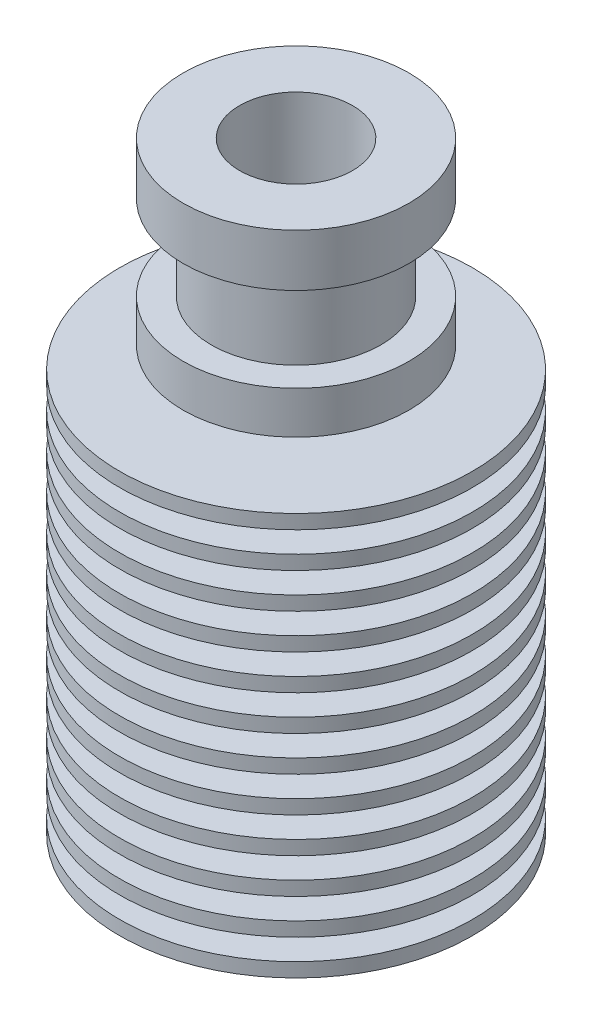
ISO-10303-21;
HEADER;
FILE_DESCRIPTION(('STEP AP214'),'2;1');
FILE_NAME('part.step','',(''),(''),'','','');
FILE_SCHEMA(('AUTOMOTIVE_DESIGN { 1 0 10303 214 1 1 1 1 }'));
ENDSEC;
DATA;
#1=APPLICATION_CONTEXT('core data for automotive mechanical design processes');
#2=APPLICATION_PROTOCOL_DEFINITION('international standard','automotive_design',2000,#1);
#3=PRODUCT_CONTEXT('',#1,'mechanical');
#4=PRODUCT('Part','Part','',(#3));
#5=PRODUCT_RELATED_PRODUCT_CATEGORY('part','',(#4));
#6=PRODUCT_DEFINITION_FORMATION('','',#4);
#7=PRODUCT_DEFINITION_CONTEXT('part definition',#1,'design');
#8=PRODUCT_DEFINITION('design','',#6,#7);
#9=PRODUCT_DEFINITION_SHAPE('','',#8);
#10=(LENGTH_UNIT() NAMED_UNIT(*) SI_UNIT(.MILLI.,.METRE.));
#11=(NAMED_UNIT(*) PLANE_ANGLE_UNIT() SI_UNIT($,.RADIAN.));
#12=(NAMED_UNIT(*) SI_UNIT($,.STERADIAN.) SOLID_ANGLE_UNIT());
#13=UNCERTAINTY_MEASURE_WITH_UNIT(LENGTH_MEASURE(1.E-05),#10,'distance_accuracy_value','');
#14=(GEOMETRIC_REPRESENTATION_CONTEXT(3) GLOBAL_UNCERTAINTY_ASSIGNED_CONTEXT((#13)) GLOBAL_UNIT_ASSIGNED_CONTEXT((#10,
#11,#12)) REPRESENTATION_CONTEXT('',''));
#15=CARTESIAN_POINT('',(0.,0.,0.));
#16=DIRECTION('',(0.,0.,1.));
#17=DIRECTION('',(1.,0.,0.));
#18=AXIS2_PLACEMENT_3D('',#15,#16,#17);
#19=CARTESIAN_POINT('',(0.,-21.35,0.));
#20=DIRECTION('',(0.,-1.,0.));
#21=DIRECTION('',(0.,0.,-1.));
#22=AXIS2_PLACEMENT_3D('',#19,#20,#21);
#23=CYLINDRICAL_SURFACE('',#22,3.5);
#24=CARTESIAN_POINT('',(0.,-21.35,0.));
#25=DIRECTION('',(0.,-1.,0.));
#26=DIRECTION('',(0.,0.,-1.));
#27=AXIS2_PLACEMENT_3D('',#24,#25,#26);
#28=CIRCLE('',#27,3.5);
#29=CARTESIAN_POINT('',(0.,-21.35,-3.5));
#30=VERTEX_POINT('',#29);
#31=EDGE_CURVE('E215',#30,#30,#28,.T.);
#32=ORIENTED_EDGE('',*,*,#31,.T.);
#33=EDGE_LOOP('',(#32));
#34=FACE_BOUND('',#33,.T.);
#35=CARTESIAN_POINT('',(0.,-6.55,0.));
#36=DIRECTION('',(0.,-1.,0.));
#37=DIRECTION('',(0.,0.,-1.));
#38=AXIS2_PLACEMENT_3D('',#35,#36,#37);
#39=CIRCLE('',#38,3.5);
#40=CARTESIAN_POINT('',(0.,-6.55,-3.5));
#41=VERTEX_POINT('',#40);
#42=EDGE_CURVE('E10',#41,#41,#39,.T.);
#43=ORIENTED_EDGE('',*,*,#42,.F.);
#44=EDGE_LOOP('',(#43));
#45=FACE_BOUND('',#44,.T.);
#46=ADVANCED_FACE('F31',(#34,#45),#23,.F.);
#47=CARTESIAN_POINT('',(0.,-5.74170962313453,0.));
#48=DIRECTION('',(0.,-1.,0.));
#49=DIRECTION('',(0.,0.,-1.));
#50=AXIS2_PLACEMENT_3D('',#47,#48,#49);
#51=CONICAL_SURFACE('',#50,2.1,1.0471975511966);
#52=ORIENTED_EDGE('',*,*,#42,.T.);
#53=EDGE_LOOP('',(#52));
#54=FACE_BOUND('',#53,.T.);
#55=CARTESIAN_POINT('',(0.,-5.74170962313453,0.));
#56=DIRECTION('',(0.,-1.,0.));
#57=DIRECTION('',(0.,0.,-1.));
#58=AXIS2_PLACEMENT_3D('',#55,#56,#57);
#59=CIRCLE('',#58,2.1);
#60=CARTESIAN_POINT('',(0.,-5.74170962313453,-2.1));
#61=VERTEX_POINT('',#60);
#62=EDGE_CURVE('E37',#61,#61,#59,.T.);
#63=ORIENTED_EDGE('',*,*,#62,.F.);
#64=EDGE_LOOP('',(#63));
#65=FACE_BOUND('',#64,.T.);
#66=ADVANCED_FACE('F233',(#54,#65),#51,.F.);
#67=CARTESIAN_POINT('',(0.,-21.35,0.));
#68=DIRECTION('',(0.,-1.,0.));
#69=DIRECTION('',(0.,0.,-1.));
#70=AXIS2_PLACEMENT_3D('',#67,#68,#69);
#71=CYLINDRICAL_SURFACE('',#70,2.1);
#72=ORIENTED_EDGE('',*,*,#62,.T.);
#73=EDGE_LOOP('',(#72));
#74=FACE_BOUND('',#73,.T.);
#75=CARTESIAN_POINT('',(0.,10.2530344885397,0.));
#76=DIRECTION('',(0.,-1.,0.));
#77=DIRECTION('',(0.,0.,-1.));
#78=AXIS2_PLACEMENT_3D('',#75,#76,#77);
#79=CIRCLE('',#78,2.1);
#80=CARTESIAN_POINT('',(0.,10.2530344885397,-2.1));
#81=VERTEX_POINT('',#80);
#82=EDGE_CURVE('E41',#81,#81,#79,.T.);
#83=ORIENTED_EDGE('',*,*,#82,.F.);
#84=EDGE_LOOP('',(#83));
#85=FACE_BOUND('',#84,.T.);
#86=ADVANCED_FACE('F237',(#74,#85),#71,.F.);
#87=CARTESIAN_POINT('',(0.,11.35,0.));
#88=DIRECTION('',(0.,1.,0.));
#89=DIRECTION('',(0.,0.,1.));
#90=AXIS2_PLACEMENT_3D('',#87,#88,#89);
#91=CONICAL_SURFACE('',#90,4.,1.0471975511966);
#92=ORIENTED_EDGE('',*,*,#82,.T.);
#93=EDGE_LOOP('',(#92));
#94=FACE_BOUND('',#93,.T.);
#95=CARTESIAN_POINT('',(0.,11.35,0.));
#96=DIRECTION('',(0.,-1.,0.));
#97=DIRECTION('',(0.,0.,-1.));
#98=AXIS2_PLACEMENT_3D('',#95,#96,#97);
#99=CIRCLE('',#98,4.);
#100=CARTESIAN_POINT('',(0.,11.35,-4.));
#101=VERTEX_POINT('',#100);
#102=EDGE_CURVE('E45',#101,#101,#99,.T.);
#103=ORIENTED_EDGE('',*,*,#102,.F.);
#104=EDGE_LOOP('',(#103));
#105=FACE_BOUND('',#104,.T.);
#106=ADVANCED_FACE('F241',(#94,#105),#91,.F.);
#107=CARTESIAN_POINT('',(0.,-21.35,0.));
#108=DIRECTION('',(0.,-1.,0.));
#109=DIRECTION('',(0.,0.,-1.));
#110=AXIS2_PLACEMENT_3D('',#107,#108,#109);
#111=CYLINDRICAL_SURFACE('',#110,4.);
#112=ORIENTED_EDGE('',*,*,#102,.T.);
#113=EDGE_LOOP('',(#112));
#114=FACE_BOUND('',#113,.T.);
#115=CARTESIAN_POINT('',(0.,21.35,0.));
#116=DIRECTION('',(0.,-1.,0.));
#117=DIRECTION('',(0.,0.,-1.));
#118=AXIS2_PLACEMENT_3D('',#115,#116,#117);
#119=CIRCLE('',#118,4.);
#120=CARTESIAN_POINT('',(0.,21.35,-4.));
#121=VERTEX_POINT('',#120);
#122=EDGE_CURVE('E50',#121,#121,#119,.T.);
#123=ORIENTED_EDGE('',*,*,#122,.F.);
#124=EDGE_LOOP('',(#123));
#125=FACE_BOUND('',#124,.T.);
#126=ADVANCED_FACE('F247',(#114,#125),#111,.F.);
#127=CARTESIAN_POINT('',(4.,21.35,0.));
#128=DIRECTION('',(0.,1.,0.));
#129=DIRECTION('',(0.,0.,1.));
#130=AXIS2_PLACEMENT_3D('',#127,#128,#129);
#131=PLANE('',#130);
#132=ORIENTED_EDGE('',*,*,#122,.T.);
#133=EDGE_LOOP('',(#132));
#134=FACE_BOUND('',#133,.T.);
#135=CARTESIAN_POINT('',(0.,21.35,0.));
#136=DIRECTION('',(0.,-1.,0.));
#137=DIRECTION('',(0.,0.,-1.));
#138=AXIS2_PLACEMENT_3D('',#135,#136,#137);
#139=CIRCLE('',#138,8.);
#140=CARTESIAN_POINT('',(0.,21.35,-8.));
#141=VERTEX_POINT('',#140);
#142=EDGE_CURVE('E53',#141,#141,#139,.T.);
#143=ORIENTED_EDGE('',*,*,#142,.F.);
#144=EDGE_LOOP('',(#143));
#145=FACE_BOUND('',#144,.T.);
#146=ADVANCED_FACE('F251',(#134,#145),#131,.T.);
#147=CARTESIAN_POINT('',(0.,-21.35,0.));
#148=DIRECTION('',(0.,-1.,0.));
#149=DIRECTION('',(0.,0.,-1.));
#150=AXIS2_PLACEMENT_3D('',#147,#148,#149);
#151=CYLINDRICAL_SURFACE('',#150,8.);
#152=ORIENTED_EDGE('',*,*,#142,.T.);
#153=EDGE_LOOP('',(#152));
#154=FACE_BOUND('',#153,.T.);
#155=CARTESIAN_POINT('',(0.,17.65,0.));
#156=DIRECTION('',(0.,-1.,0.));
#157=DIRECTION('',(0.,0.,-1.));
#158=AXIS2_PLACEMENT_3D('',#155,#156,#157);
#159=CIRCLE('',#158,8.);
#160=CARTESIAN_POINT('',(0.,17.65,-8.));
#161=VERTEX_POINT('',#160);
#162=EDGE_CURVE('E56',#161,#161,#159,.T.);
#163=ORIENTED_EDGE('',*,*,#162,.F.);
#164=EDGE_LOOP('',(#163));
#165=FACE_BOUND('',#164,.T.);
#166=ADVANCED_FACE('F255',(#154,#165),#151,.T.);
#167=CARTESIAN_POINT('',(6.,17.65,0.));
#168=DIRECTION('',(0.,-1.,0.));
#169=DIRECTION('',(0.,0.,-1.));
#170=AXIS2_PLACEMENT_3D('',#167,#168,#169);
#171=PLANE('',#170);
#172=ORIENTED_EDGE('',*,*,#162,.T.);
#173=EDGE_LOOP('',(#172));
#174=FACE_BOUND('',#173,.T.);
#175=CARTESIAN_POINT('',(0.,17.65,0.));
#176=DIRECTION('',(0.,-1.,0.));
#177=DIRECTION('',(0.,0.,-1.));
#178=AXIS2_PLACEMENT_3D('',#175,#176,#177);
#179=CIRCLE('',#178,6.);
#180=CARTESIAN_POINT('',(0.,17.65,-6.));
#181=VERTEX_POINT('',#180);
#182=EDGE_CURVE('E59',#181,#181,#179,.T.);
#183=ORIENTED_EDGE('',*,*,#182,.F.);
#184=EDGE_LOOP('',(#183));
#185=FACE_BOUND('',#184,.T.);
#186=ADVANCED_FACE('F259',(#174,#185),#171,.T.);
#187=CARTESIAN_POINT('',(0.,-21.35,0.));
#188=DIRECTION('',(0.,-1.,0.));
#189=DIRECTION('',(0.,0.,-1.));
#190=AXIS2_PLACEMENT_3D('',#187,#188,#189);
#191=CYLINDRICAL_SURFACE('',#190,6.);
#192=ORIENTED_EDGE('',*,*,#182,.T.);
#193=EDGE_LOOP('',(#192));
#194=FACE_BOUND('',#193,.T.);
#195=CARTESIAN_POINT('',(0.,11.65,0.));
#196=DIRECTION('',(0.,-1.,0.));
#197=DIRECTION('',(0.,0.,-1.));
#198=AXIS2_PLACEMENT_3D('',#195,#196,#197);
#199=CIRCLE('',#198,6.);
#200=CARTESIAN_POINT('',(0.,11.65,-6.));
#201=VERTEX_POINT('',#200);
#202=EDGE_CURVE('E62',#201,#201,#199,.T.);
#203=ORIENTED_EDGE('',*,*,#202,.F.);
#204=EDGE_LOOP('',(#203));
#205=FACE_BOUND('',#204,.T.);
#206=ADVANCED_FACE('F263',(#194,#205),#191,.T.);
#207=CARTESIAN_POINT('',(8.,11.65,0.));
#208=DIRECTION('',(0.,1.,0.));
#209=DIRECTION('',(0.,0.,1.));
#210=AXIS2_PLACEMENT_3D('',#207,#208,#209);
#211=PLANE('',#210);
#212=ORIENTED_EDGE('',*,*,#202,.T.);
#213=EDGE_LOOP('',(#212));
#214=FACE_BOUND('',#213,.T.);
#215=CARTESIAN_POINT('',(0.,11.65,0.));
#216=DIRECTION('',(0.,-1.,0.));
#217=DIRECTION('',(0.,0.,-1.));
#218=AXIS2_PLACEMENT_3D('',#215,#216,#217);
#219=CIRCLE('',#218,8.);
#220=CARTESIAN_POINT('',(0.,11.65,-8.));
#221=VERTEX_POINT('',#220);
#222=EDGE_CURVE('E65',#221,#221,#219,.T.);
#223=ORIENTED_EDGE('',*,*,#222,.F.);
#224=EDGE_LOOP('',(#223));
#225=FACE_BOUND('',#224,.T.);
#226=ADVANCED_FACE('F267',(#214,#225),#211,.T.);
#227=CARTESIAN_POINT('',(0.,-21.35,0.));
#228=DIRECTION('',(0.,-1.,0.));
#229=DIRECTION('',(0.,0.,-1.));
#230=AXIS2_PLACEMENT_3D('',#227,#228,#229);
#231=CYLINDRICAL_SURFACE('',#230,8.);
#232=ORIENTED_EDGE('',*,*,#222,.T.);
#233=EDGE_LOOP('',(#232));
#234=FACE_BOUND('',#233,.T.);
#235=CARTESIAN_POINT('',(0.,8.65,0.));
#236=DIRECTION('',(0.,-1.,0.));
#237=DIRECTION('',(0.,0.,-1.));
#238=AXIS2_PLACEMENT_3D('',#235,#236,#237);
#239=CIRCLE('',#238,8.);
#240=CARTESIAN_POINT('',(0.,8.65,-8.));
#241=VERTEX_POINT('',#240);
#242=EDGE_CURVE('E68',#241,#241,#239,.T.);
#243=ORIENTED_EDGE('',*,*,#242,.F.);
#244=EDGE_LOOP('',(#243));
#245=FACE_BOUND('',#244,.T.);
#246=ADVANCED_FACE('F271',(#234,#245),#231,.T.);
#247=CARTESIAN_POINT('',(4.3975,8.65,0.));
#248=DIRECTION('',(0.,-1.,0.));
#249=DIRECTION('',(0.,0.,-1.));
#250=AXIS2_PLACEMENT_3D('',#247,#248,#249);
#251=PLANE('',#250);
#252=ORIENTED_EDGE('',*,*,#242,.T.);
#253=EDGE_LOOP('',(#252));
#254=FACE_BOUND('',#253,.T.);
#255=CARTESIAN_POINT('',(0.,8.65,0.));
#256=DIRECTION('',(0.,-1.,0.));
#257=DIRECTION('',(0.,0.,-1.));
#258=AXIS2_PLACEMENT_3D('',#255,#256,#257);
#259=CIRCLE('',#258,4.3975);
#260=CARTESIAN_POINT('',(0.,8.65,-4.3975));
#261=VERTEX_POINT('',#260);
#262=EDGE_CURVE('E71',#261,#261,#259,.T.);
#263=ORIENTED_EDGE('',*,*,#262,.F.);
#264=EDGE_LOOP('',(#263));
#265=FACE_BOUND('',#264,.T.);
#266=ADVANCED_FACE('F275',(#254,#265),#251,.T.);
#267=CARTESIAN_POINT('',(0.,-21.35,0.));
#268=DIRECTION('',(0.,-1.,0.));
#269=DIRECTION('',(0.,0.,-1.));
#270=AXIS2_PLACEMENT_3D('',#267,#268,#269);
#271=CYLINDRICAL_SURFACE('',#270,4.3975);
#272=ORIENTED_EDGE('',*,*,#262,.T.);
#273=EDGE_LOOP('',(#272));
#274=FACE_BOUND('',#273,.T.);
#275=CARTESIAN_POINT('',(0.,7.15,0.));
#276=DIRECTION('',(0.,-1.,0.));
#277=DIRECTION('',(0.,0.,-1.));
#278=AXIS2_PLACEMENT_3D('',#275,#276,#277);
#279=CIRCLE('',#278,4.3975);
#280=CARTESIAN_POINT('',(0.,7.15,-4.3975));
#281=VERTEX_POINT('',#280);
#282=EDGE_CURVE('E74',#281,#281,#279,.T.);
#283=ORIENTED_EDGE('',*,*,#282,.F.);
#284=EDGE_LOOP('',(#283));
#285=FACE_BOUND('',#284,.T.);
#286=ADVANCED_FACE('F279',(#274,#285),#271,.T.);
#287=CARTESIAN_POINT('',(4.3975,7.15,0.));
#288=DIRECTION('',(0.,1.,0.));
#289=DIRECTION('',(0.,0.,1.));
#290=AXIS2_PLACEMENT_3D('',#287,#288,#289);
#291=PLANE('',#290);
#292=ORIENTED_EDGE('',*,*,#282,.T.);
#293=EDGE_LOOP('',(#292));
#294=FACE_BOUND('',#293,.T.);
#295=CARTESIAN_POINT('',(0.,7.15,0.));
#296=DIRECTION('',(0.,-1.,0.));
#297=DIRECTION('',(0.,0.,-1.));
#298=AXIS2_PLACEMENT_3D('',#295,#296,#297);
#299=CIRCLE('',#298,12.5);
#300=CARTESIAN_POINT('',(0.,7.15,-12.5));
#301=VERTEX_POINT('',#300);
#302=EDGE_CURVE('E77',#301,#301,#299,.T.);
#303=ORIENTED_EDGE('',*,*,#302,.F.);
#304=EDGE_LOOP('',(#303));
#305=FACE_BOUND('',#304,.T.);
#306=ADVANCED_FACE('F283',(#294,#305),#291,.T.);
#307=CARTESIAN_POINT('',(0.,-21.35,0.));
#308=DIRECTION('',(0.,-1.,0.));
#309=DIRECTION('',(0.,0.,-1.));
#310=AXIS2_PLACEMENT_3D('',#307,#308,#309);
#311=CYLINDRICAL_SURFACE('',#310,12.5);
#312=ORIENTED_EDGE('',*,*,#302,.T.);
#313=EDGE_LOOP('',(#312));
#314=FACE_BOUND('',#313,.T.);
#315=CARTESIAN_POINT('',(0.,6.15,0.));
#316=DIRECTION('',(0.,-1.,0.));
#317=DIRECTION('',(0.,0.,-1.));
#318=AXIS2_PLACEMENT_3D('',#315,#316,#317);
#319=CIRCLE('',#318,12.5);
#320=CARTESIAN_POINT('',(0.,6.15,-12.5));
#321=VERTEX_POINT('',#320);
#322=EDGE_CURVE('E80',#321,#321,#319,.T.);
#323=ORIENTED_EDGE('',*,*,#322,.F.);
#324=EDGE_LOOP('',(#323));
#325=FACE_BOUND('',#324,.T.);
#326=ADVANCED_FACE('F287',(#314,#325),#311,.T.);
#327=CARTESIAN_POINT('',(12.5,6.15,0.));
#328=DIRECTION('',(0.,-1.,0.));
#329=DIRECTION('',(0.,0.,-1.));
#330=AXIS2_PLACEMENT_3D('',#327,#328,#329);
#331=PLANE('',#330);
#332=ORIENTED_EDGE('',*,*,#322,.T.);
#333=EDGE_LOOP('',(#332));
#334=FACE_BOUND('',#333,.T.);
#335=CARTESIAN_POINT('',(0.,6.15,0.));
#336=DIRECTION('',(0.,-1.,0.));
#337=DIRECTION('',(0.,0.,-1.));
#338=AXIS2_PLACEMENT_3D('',#335,#336,#337);
#339=CIRCLE('',#338,4.3975);
#340=CARTESIAN_POINT('',(0.,6.15,-4.3975));
#341=VERTEX_POINT('',#340);
#342=EDGE_CURVE('E83',#341,#341,#339,.T.);
#343=ORIENTED_EDGE('',*,*,#342,.F.);
#344=EDGE_LOOP('',(#343));
#345=FACE_BOUND('',#344,.T.);
#346=ADVANCED_FACE('F291',(#334,#345),#331,.T.);
#347=CARTESIAN_POINT('',(0.,-21.35,0.));
#348=DIRECTION('',(0.,-1.,0.));
#349=DIRECTION('',(0.,0.,-1.));
#350=AXIS2_PLACEMENT_3D('',#347,#348,#349);
#351=CYLINDRICAL_SURFACE('',#350,4.3975);
#352=ORIENTED_EDGE('',*,*,#342,.T.);
#353=EDGE_LOOP('',(#352));
#354=FACE_BOUND('',#353,.T.);
#355=CARTESIAN_POINT('',(0.,4.65,0.));
#356=DIRECTION('',(0.,-1.,0.));
#357=DIRECTION('',(0.,0.,-1.));
#358=AXIS2_PLACEMENT_3D('',#355,#356,#357);
#359=CIRCLE('',#358,4.3975);
#360=CARTESIAN_POINT('',(0.,4.65,-4.3975));
#361=VERTEX_POINT('',#360);
#362=EDGE_CURVE('E86',#361,#361,#359,.T.);
#363=ORIENTED_EDGE('',*,*,#362,.F.);
#364=EDGE_LOOP('',(#363));
#365=FACE_BOUND('',#364,.T.);
#366=ADVANCED_FACE('F295',(#354,#365),#351,.T.);
#367=CARTESIAN_POINT('',(4.3975,4.65,0.));
#368=DIRECTION('',(0.,1.,0.));
#369=DIRECTION('',(0.,0.,1.));
#370=AXIS2_PLACEMENT_3D('',#367,#368,#369);
#371=PLANE('',#370);
#372=ORIENTED_EDGE('',*,*,#362,.T.);
#373=EDGE_LOOP('',(#372));
#374=FACE_BOUND('',#373,.T.);
#375=CARTESIAN_POINT('',(0.,4.65,0.));
#376=DIRECTION('',(0.,-1.,0.));
#377=DIRECTION('',(0.,0.,-1.));
#378=AXIS2_PLACEMENT_3D('',#375,#376,#377);
#379=CIRCLE('',#378,12.5);
#380=CARTESIAN_POINT('',(0.,4.65,-12.5));
#381=VERTEX_POINT('',#380);
#382=EDGE_CURVE('E89',#381,#381,#379,.T.);
#383=ORIENTED_EDGE('',*,*,#382,.F.);
#384=EDGE_LOOP('',(#383));
#385=FACE_BOUND('',#384,.T.);
#386=ADVANCED_FACE('F299',(#374,#385),#371,.T.);
#387=CARTESIAN_POINT('',(0.,-21.35,0.));
#388=DIRECTION('',(0.,-1.,0.));
#389=DIRECTION('',(0.,0.,-1.));
#390=AXIS2_PLACEMENT_3D('',#387,#388,#389);
#391=CYLINDRICAL_SURFACE('',#390,12.5);
#392=ORIENTED_EDGE('',*,*,#382,.T.);
#393=EDGE_LOOP('',(#392));
#394=FACE_BOUND('',#393,.T.);
#395=CARTESIAN_POINT('',(0.,3.65,0.));
#396=DIRECTION('',(0.,-1.,0.));
#397=DIRECTION('',(0.,0.,-1.));
#398=AXIS2_PLACEMENT_3D('',#395,#396,#397);
#399=CIRCLE('',#398,12.5);
#400=CARTESIAN_POINT('',(0.,3.65,-12.5));
#401=VERTEX_POINT('',#400);
#402=EDGE_CURVE('E92',#401,#401,#399,.T.);
#403=ORIENTED_EDGE('',*,*,#402,.F.);
#404=EDGE_LOOP('',(#403));
#405=FACE_BOUND('',#404,.T.);
#406=ADVANCED_FACE('F303',(#394,#405),#391,.T.);
#407=CARTESIAN_POINT('',(12.5,3.65,0.));
#408=DIRECTION('',(0.,-1.,0.));
#409=DIRECTION('',(0.,0.,-1.));
#410=AXIS2_PLACEMENT_3D('',#407,#408,#409);
#411=PLANE('',#410);
#412=ORIENTED_EDGE('',*,*,#402,.T.);
#413=EDGE_LOOP('',(#412));
#414=FACE_BOUND('',#413,.T.);
#415=CARTESIAN_POINT('',(0.,3.65,0.));
#416=DIRECTION('',(0.,-1.,0.));
#417=DIRECTION('',(0.,0.,-1.));
#418=AXIS2_PLACEMENT_3D('',#415,#416,#417);
#419=CIRCLE('',#418,4.58175);
#420=CARTESIAN_POINT('',(0.,3.65,-4.58175));
#421=VERTEX_POINT('',#420);
#422=EDGE_CURVE('E95',#421,#421,#419,.T.);
#423=ORIENTED_EDGE('',*,*,#422,.F.);
#424=EDGE_LOOP('',(#423));
#425=FACE_BOUND('',#424,.T.);
#426=ADVANCED_FACE('F307',(#414,#425),#411,.T.);
#427=CARTESIAN_POINT('',(0.,-21.35,0.));
#428=DIRECTION('',(0.,-1.,0.));
#429=DIRECTION('',(0.,0.,-1.));
#430=AXIS2_PLACEMENT_3D('',#427,#428,#429);
#431=CYLINDRICAL_SURFACE('',#430,4.58175);
#432=ORIENTED_EDGE('',*,*,#422,.T.);
#433=EDGE_LOOP('',(#432));
#434=FACE_BOUND('',#433,.T.);
#435=CARTESIAN_POINT('',(0.,2.15,0.));
#436=DIRECTION('',(0.,-1.,0.));
#437=DIRECTION('',(0.,0.,-1.));
#438=AXIS2_PLACEMENT_3D('',#435,#436,#437);
#439=CIRCLE('',#438,4.58175);
#440=CARTESIAN_POINT('',(0.,2.15,-4.58175));
#441=VERTEX_POINT('',#440);
#442=EDGE_CURVE('E98',#441,#441,#439,.T.);
#443=ORIENTED_EDGE('',*,*,#442,.F.);
#444=EDGE_LOOP('',(#443));
#445=FACE_BOUND('',#444,.T.);
#446=ADVANCED_FACE('F311',(#434,#445),#431,.T.);
#447=CARTESIAN_POINT('',(4.58175,2.14999999999999,0.));
#448=DIRECTION('',(0.,1.,0.));
#449=DIRECTION('',(0.,0.,1.));
#450=AXIS2_PLACEMENT_3D('',#447,#448,#449);
#451=PLANE('',#450);
#452=ORIENTED_EDGE('',*,*,#442,.T.);
#453=EDGE_LOOP('',(#452));
#454=FACE_BOUND('',#453,.T.);
#455=CARTESIAN_POINT('',(0.,2.15,0.));
#456=DIRECTION('',(0.,-1.,0.));
#457=DIRECTION('',(0.,0.,-1.));
#458=AXIS2_PLACEMENT_3D('',#455,#456,#457);
#459=CIRCLE('',#458,12.5);
#460=CARTESIAN_POINT('',(0.,2.15,-12.5));
#461=VERTEX_POINT('',#460);
#462=EDGE_CURVE('E101',#461,#461,#459,.T.);
#463=ORIENTED_EDGE('',*,*,#462,.F.);
#464=EDGE_LOOP('',(#463));
#465=FACE_BOUND('',#464,.T.);
#466=ADVANCED_FACE('F315',(#454,#465),#451,.T.);
#467=CARTESIAN_POINT('',(0.,-21.35,0.));
#468=DIRECTION('',(0.,-1.,0.));
#469=DIRECTION('',(0.,0.,-1.));
#470=AXIS2_PLACEMENT_3D('',#467,#468,#469);
#471=CYLINDRICAL_SURFACE('',#470,12.5);
#472=ORIENTED_EDGE('',*,*,#462,.T.);
#473=EDGE_LOOP('',(#472));
#474=FACE_BOUND('',#473,.T.);
#475=CARTESIAN_POINT('',(0.,1.14999999999999,0.));
#476=DIRECTION('',(0.,-1.,0.));
#477=DIRECTION('',(0.,0.,-1.));
#478=AXIS2_PLACEMENT_3D('',#475,#476,#477);
#479=CIRCLE('',#478,12.5);
#480=CARTESIAN_POINT('',(0.,1.14999999999999,-12.5));
#481=VERTEX_POINT('',#480);
#482=EDGE_CURVE('E104',#481,#481,#479,.T.);
#483=ORIENTED_EDGE('',*,*,#482,.F.);
#484=EDGE_LOOP('',(#483));
#485=FACE_BOUND('',#484,.T.);
#486=ADVANCED_FACE('F319',(#474,#485),#471,.T.);
#487=CARTESIAN_POINT('',(12.5,1.14999999999999,0.));
#488=DIRECTION('',(0.,-1.,0.));
#489=DIRECTION('',(0.,0.,-1.));
#490=AXIS2_PLACEMENT_3D('',#487,#488,#489);
#491=PLANE('',#490);
#492=ORIENTED_EDGE('',*,*,#482,.T.);
#493=EDGE_LOOP('',(#492));
#494=FACE_BOUND('',#493,.T.);
#495=CARTESIAN_POINT('',(0.,1.14999999999999,0.));
#496=DIRECTION('',(0.,-1.,0.));
#497=DIRECTION('',(0.,0.,-1.));
#498=AXIS2_PLACEMENT_3D('',#495,#496,#497);
#499=CIRCLE('',#498,4.766);
#500=CARTESIAN_POINT('',(0.,1.14999999999999,-4.766));
#501=VERTEX_POINT('',#500);
#502=EDGE_CURVE('E107',#501,#501,#499,.T.);
#503=ORIENTED_EDGE('',*,*,#502,.F.);
#504=EDGE_LOOP('',(#503));
#505=FACE_BOUND('',#504,.T.);
#506=ADVANCED_FACE('F323',(#494,#505),#491,.T.);
#507=CARTESIAN_POINT('',(0.,-21.35,0.));
#508=DIRECTION('',(0.,-1.,0.));
#509=DIRECTION('',(0.,0.,-1.));
#510=AXIS2_PLACEMENT_3D('',#507,#508,#509);
#511=CYLINDRICAL_SURFACE('',#510,4.766);
#512=ORIENTED_EDGE('',*,*,#502,.T.);
#513=EDGE_LOOP('',(#512));
#514=FACE_BOUND('',#513,.T.);
#515=CARTESIAN_POINT('',(0.,-0.35000000000001,0.));
#516=DIRECTION('',(0.,-1.,0.));
#517=DIRECTION('',(0.,0.,-1.));
#518=AXIS2_PLACEMENT_3D('',#515,#516,#517);
#519=CIRCLE('',#518,4.766);
#520=CARTESIAN_POINT('',(0.,-0.35000000000001,-4.766));
#521=VERTEX_POINT('',#520);
#522=EDGE_CURVE('E110',#521,#521,#519,.T.);
#523=ORIENTED_EDGE('',*,*,#522,.F.);
#524=EDGE_LOOP('',(#523));
#525=FACE_BOUND('',#524,.T.);
#526=ADVANCED_FACE('F327',(#514,#525),#511,.T.);
#527=CARTESIAN_POINT('',(4.766,-0.350000000000009,0.));
#528=DIRECTION('',(0.,1.,0.));
#529=DIRECTION('',(0.,0.,1.));
#530=AXIS2_PLACEMENT_3D('',#527,#528,#529);
#531=PLANE('',#530);
#532=ORIENTED_EDGE('',*,*,#522,.T.);
#533=EDGE_LOOP('',(#532));
#534=FACE_BOUND('',#533,.T.);
#535=CARTESIAN_POINT('',(0.,-0.350000000000007,0.));
#536=DIRECTION('',(0.,-1.,0.));
#537=DIRECTION('',(0.,0.,-1.));
#538=AXIS2_PLACEMENT_3D('',#535,#536,#537);
#539=CIRCLE('',#538,12.5);
#540=CARTESIAN_POINT('',(0.,-0.350000000000007,-12.5));
#541=VERTEX_POINT('',#540);
#542=EDGE_CURVE('E113',#541,#541,#539,.T.);
#543=ORIENTED_EDGE('',*,*,#542,.F.);
#544=EDGE_LOOP('',(#543));
#545=FACE_BOUND('',#544,.T.);
#546=ADVANCED_FACE('F331',(#534,#545),#531,.T.);
#547=CARTESIAN_POINT('',(0.,-21.35,0.));
#548=DIRECTION('',(0.,-1.,0.));
#549=DIRECTION('',(0.,0.,-1.));
#550=AXIS2_PLACEMENT_3D('',#547,#548,#549);
#551=CYLINDRICAL_SURFACE('',#550,12.5);
#552=ORIENTED_EDGE('',*,*,#542,.T.);
#553=EDGE_LOOP('',(#552));
#554=FACE_BOUND('',#553,.T.);
#555=CARTESIAN_POINT('',(0.,-1.35000000000001,0.));
#556=DIRECTION('',(0.,-1.,0.));
#557=DIRECTION('',(0.,0.,-1.));
#558=AXIS2_PLACEMENT_3D('',#555,#556,#557);
#559=CIRCLE('',#558,12.5);
#560=CARTESIAN_POINT('',(0.,-1.35000000000001,-12.5));
#561=VERTEX_POINT('',#560);
#562=EDGE_CURVE('E116',#561,#561,#559,.T.);
#563=ORIENTED_EDGE('',*,*,#562,.F.);
#564=EDGE_LOOP('',(#563));
#565=FACE_BOUND('',#564,.T.);
#566=ADVANCED_FACE('F335',(#554,#565),#551,.T.);
#567=CARTESIAN_POINT('',(12.5,-1.35000000000001,0.));
#568=DIRECTION('',(0.,-1.,0.));
#569=DIRECTION('',(0.,0.,-1.));
#570=AXIS2_PLACEMENT_3D('',#567,#568,#569);
#571=PLANE('',#570);
#572=ORIENTED_EDGE('',*,*,#562,.T.);
#573=EDGE_LOOP('',(#572));
#574=FACE_BOUND('',#573,.T.);
#575=CARTESIAN_POINT('',(0.,-1.35000000000001,0.));
#576=DIRECTION('',(0.,-1.,0.));
#577=DIRECTION('',(0.,0.,-1.));
#578=AXIS2_PLACEMENT_3D('',#575,#576,#577);
#579=CIRCLE('',#578,4.95025);
#580=CARTESIAN_POINT('',(0.,-1.35000000000001,-4.95025));
#581=VERTEX_POINT('',#580);
#582=EDGE_CURVE('E119',#581,#581,#579,.T.);
#583=ORIENTED_EDGE('',*,*,#582,.F.);
#584=EDGE_LOOP('',(#583));
#585=FACE_BOUND('',#584,.T.);
#586=ADVANCED_FACE('F339',(#574,#585),#571,.T.);
#587=CARTESIAN_POINT('',(0.,-21.35,0.));
#588=DIRECTION('',(0.,-1.,0.));
#589=DIRECTION('',(0.,0.,-1.));
#590=AXIS2_PLACEMENT_3D('',#587,#588,#589);
#591=CYLINDRICAL_SURFACE('',#590,4.95025);
#592=ORIENTED_EDGE('',*,*,#582,.T.);
#593=EDGE_LOOP('',(#592));
#594=FACE_BOUND('',#593,.T.);
#595=CARTESIAN_POINT('',(0.,-2.85000000000001,0.));
#596=DIRECTION('',(0.,-1.,0.));
#597=DIRECTION('',(0.,0.,-1.));
#598=AXIS2_PLACEMENT_3D('',#595,#596,#597);
#599=CIRCLE('',#598,4.95025);
#600=CARTESIAN_POINT('',(0.,-2.85000000000001,-4.95025));
#601=VERTEX_POINT('',#600);
#602=EDGE_CURVE('E122',#601,#601,#599,.T.);
#603=ORIENTED_EDGE('',*,*,#602,.F.);
#604=EDGE_LOOP('',(#603));
#605=FACE_BOUND('',#604,.T.);
#606=ADVANCED_FACE('F343',(#594,#605),#591,.T.);
#607=CARTESIAN_POINT('',(4.95025,-2.85000000000001,0.));
#608=DIRECTION('',(0.,1.,0.));
#609=DIRECTION('',(0.,0.,1.));
#610=AXIS2_PLACEMENT_3D('',#607,#608,#609);
#611=PLANE('',#610);
#612=ORIENTED_EDGE('',*,*,#602,.T.);
#613=EDGE_LOOP('',(#612));
#614=FACE_BOUND('',#613,.T.);
#615=CARTESIAN_POINT('',(0.,-2.85000000000001,0.));
#616=DIRECTION('',(0.,-1.,0.));
#617=DIRECTION('',(0.,0.,-1.));
#618=AXIS2_PLACEMENT_3D('',#615,#616,#617);
#619=CIRCLE('',#618,12.5);
#620=CARTESIAN_POINT('',(0.,-2.85000000000001,-12.5));
#621=VERTEX_POINT('',#620);
#622=EDGE_CURVE('E125',#621,#621,#619,.T.);
#623=ORIENTED_EDGE('',*,*,#622,.F.);
#624=EDGE_LOOP('',(#623));
#625=FACE_BOUND('',#624,.T.);
#626=ADVANCED_FACE('F347',(#614,#625),#611,.T.);
#627=CARTESIAN_POINT('',(0.,-21.35,0.));
#628=DIRECTION('',(0.,-1.,0.));
#629=DIRECTION('',(0.,0.,-1.));
#630=AXIS2_PLACEMENT_3D('',#627,#628,#629);
#631=CYLINDRICAL_SURFACE('',#630,12.5);
#632=ORIENTED_EDGE('',*,*,#622,.T.);
#633=EDGE_LOOP('',(#632));
#634=FACE_BOUND('',#633,.T.);
#635=CARTESIAN_POINT('',(0.,-3.85000000000001,0.));
#636=DIRECTION('',(0.,-1.,0.));
#637=DIRECTION('',(0.,0.,-1.));
#638=AXIS2_PLACEMENT_3D('',#635,#636,#637);
#639=CIRCLE('',#638,12.5);
#640=CARTESIAN_POINT('',(0.,-3.85000000000001,-12.5));
#641=VERTEX_POINT('',#640);
#642=EDGE_CURVE('E128',#641,#641,#639,.T.);
#643=ORIENTED_EDGE('',*,*,#642,.F.);
#644=EDGE_LOOP('',(#643));
#645=FACE_BOUND('',#644,.T.);
#646=ADVANCED_FACE('F351',(#634,#645),#631,.T.);
#647=CARTESIAN_POINT('',(12.5,-3.85000000000001,0.));
#648=DIRECTION('',(0.,-1.,0.));
#649=DIRECTION('',(0.,0.,-1.));
#650=AXIS2_PLACEMENT_3D('',#647,#648,#649);
#651=PLANE('',#650);
#652=ORIENTED_EDGE('',*,*,#642,.T.);
#653=EDGE_LOOP('',(#652));
#654=FACE_BOUND('',#653,.T.);
#655=CARTESIAN_POINT('',(0.,-3.85000000000001,0.));
#656=DIRECTION('',(0.,-1.,0.));
#657=DIRECTION('',(0.,0.,-1.));
#658=AXIS2_PLACEMENT_3D('',#655,#656,#657);
#659=CIRCLE('',#658,5.1345);
#660=CARTESIAN_POINT('',(0.,-3.85000000000001,-5.1345));
#661=VERTEX_POINT('',#660);
#662=EDGE_CURVE('E131',#661,#661,#659,.T.);
#663=ORIENTED_EDGE('',*,*,#662,.F.);
#664=EDGE_LOOP('',(#663));
#665=FACE_BOUND('',#664,.T.);
#666=ADVANCED_FACE('F355',(#654,#665),#651,.T.);
#667=CARTESIAN_POINT('',(0.,-21.35,0.));
#668=DIRECTION('',(0.,-1.,0.));
#669=DIRECTION('',(0.,0.,-1.));
#670=AXIS2_PLACEMENT_3D('',#667,#668,#669);
#671=CYLINDRICAL_SURFACE('',#670,5.1345);
#672=ORIENTED_EDGE('',*,*,#662,.T.);
#673=EDGE_LOOP('',(#672));
#674=FACE_BOUND('',#673,.T.);
#675=CARTESIAN_POINT('',(0.,-5.35000000000001,0.));
#676=DIRECTION('',(0.,-1.,0.));
#677=DIRECTION('',(0.,0.,-1.));
#678=AXIS2_PLACEMENT_3D('',#675,#676,#677);
#679=CIRCLE('',#678,5.1345);
#680=CARTESIAN_POINT('',(0.,-5.35000000000001,-5.1345));
#681=VERTEX_POINT('',#680);
#682=EDGE_CURVE('E134',#681,#681,#679,.T.);
#683=ORIENTED_EDGE('',*,*,#682,.F.);
#684=EDGE_LOOP('',(#683));
#685=FACE_BOUND('',#684,.T.);
#686=ADVANCED_FACE('F359',(#674,#685),#671,.T.);
#687=CARTESIAN_POINT('',(5.1345,-5.35000000000001,0.));
#688=DIRECTION('',(0.,1.,0.));
#689=DIRECTION('',(0.,0.,1.));
#690=AXIS2_PLACEMENT_3D('',#687,#688,#689);
#691=PLANE('',#690);
#692=ORIENTED_EDGE('',*,*,#682,.T.);
#693=EDGE_LOOP('',(#692));
#694=FACE_BOUND('',#693,.T.);
#695=CARTESIAN_POINT('',(0.,-5.35000000000001,0.));
#696=DIRECTION('',(0.,-1.,0.));
#697=DIRECTION('',(0.,0.,-1.));
#698=AXIS2_PLACEMENT_3D('',#695,#696,#697);
#699=CIRCLE('',#698,12.5);
#700=CARTESIAN_POINT('',(0.,-5.35000000000001,-12.5));
#701=VERTEX_POINT('',#700);
#702=EDGE_CURVE('E137',#701,#701,#699,.T.);
#703=ORIENTED_EDGE('',*,*,#702,.F.);
#704=EDGE_LOOP('',(#703));
#705=FACE_BOUND('',#704,.T.);
#706=ADVANCED_FACE('F363',(#694,#705),#691,.T.);
#707=CARTESIAN_POINT('',(0.,-21.35,0.));
#708=DIRECTION('',(0.,-1.,0.));
#709=DIRECTION('',(0.,0.,-1.));
#710=AXIS2_PLACEMENT_3D('',#707,#708,#709);
#711=CYLINDRICAL_SURFACE('',#710,12.5);
#712=ORIENTED_EDGE('',*,*,#702,.T.);
#713=EDGE_LOOP('',(#712));
#714=FACE_BOUND('',#713,.T.);
#715=CARTESIAN_POINT('',(0.,-6.35000000000002,0.));
#716=DIRECTION('',(0.,-1.,0.));
#717=DIRECTION('',(0.,0.,-1.));
#718=AXIS2_PLACEMENT_3D('',#715,#716,#717);
#719=CIRCLE('',#718,12.5);
#720=CARTESIAN_POINT('',(0.,-6.35000000000002,-12.5));
#721=VERTEX_POINT('',#720);
#722=EDGE_CURVE('E140',#721,#721,#719,.T.);
#723=ORIENTED_EDGE('',*,*,#722,.F.);
#724=EDGE_LOOP('',(#723));
#725=FACE_BOUND('',#724,.T.);
#726=ADVANCED_FACE('F367',(#714,#725),#711,.T.);
#727=CARTESIAN_POINT('',(12.5,-6.35000000000002,0.));
#728=DIRECTION('',(0.,-1.,0.));
#729=DIRECTION('',(0.,0.,-1.));
#730=AXIS2_PLACEMENT_3D('',#727,#728,#729);
#731=PLANE('',#730);
#732=ORIENTED_EDGE('',*,*,#722,.T.);
#733=EDGE_LOOP('',(#732));
#734=FACE_BOUND('',#733,.T.);
#735=CARTESIAN_POINT('',(0.,-6.35000000000002,0.));
#736=DIRECTION('',(0.,-1.,0.));
#737=DIRECTION('',(0.,0.,-1.));
#738=AXIS2_PLACEMENT_3D('',#735,#736,#737);
#739=CIRCLE('',#738,5.31875);
#740=CARTESIAN_POINT('',(0.,-6.35000000000002,-5.31875));
#741=VERTEX_POINT('',#740);
#742=EDGE_CURVE('E143',#741,#741,#739,.T.);
#743=ORIENTED_EDGE('',*,*,#742,.F.);
#744=EDGE_LOOP('',(#743));
#745=FACE_BOUND('',#744,.T.);
#746=ADVANCED_FACE('F371',(#734,#745),#731,.T.);
#747=CARTESIAN_POINT('',(0.,-21.35,0.));
#748=DIRECTION('',(0.,-1.,0.));
#749=DIRECTION('',(0.,0.,-1.));
#750=AXIS2_PLACEMENT_3D('',#747,#748,#749);
#751=CYLINDRICAL_SURFACE('',#750,5.31875);
#752=ORIENTED_EDGE('',*,*,#742,.T.);
#753=EDGE_LOOP('',(#752));
#754=FACE_BOUND('',#753,.T.);
#755=CARTESIAN_POINT('',(0.,-7.85000000000002,0.));
#756=DIRECTION('',(0.,-1.,0.));
#757=DIRECTION('',(0.,0.,-1.));
#758=AXIS2_PLACEMENT_3D('',#755,#756,#757);
#759=CIRCLE('',#758,5.31875);
#760=CARTESIAN_POINT('',(0.,-7.85000000000002,-5.31875));
#761=VERTEX_POINT('',#760);
#762=EDGE_CURVE('E146',#761,#761,#759,.T.);
#763=ORIENTED_EDGE('',*,*,#762,.F.);
#764=EDGE_LOOP('',(#763));
#765=FACE_BOUND('',#764,.T.);
#766=ADVANCED_FACE('F375',(#754,#765),#751,.T.);
#767=CARTESIAN_POINT('',(5.31875,-7.85000000000002,0.));
#768=DIRECTION('',(0.,1.,0.));
#769=DIRECTION('',(0.,0.,1.));
#770=AXIS2_PLACEMENT_3D('',#767,#768,#769);
#771=PLANE('',#770);
#772=ORIENTED_EDGE('',*,*,#762,.T.);
#773=EDGE_LOOP('',(#772));
#774=FACE_BOUND('',#773,.T.);
#775=CARTESIAN_POINT('',(0.,-7.85000000000002,0.));
#776=DIRECTION('',(0.,-1.,0.));
#777=DIRECTION('',(0.,0.,-1.));
#778=AXIS2_PLACEMENT_3D('',#775,#776,#777);
#779=CIRCLE('',#778,12.5);
#780=CARTESIAN_POINT('',(0.,-7.85000000000002,-12.5));
#781=VERTEX_POINT('',#780);
#782=EDGE_CURVE('E149',#781,#781,#779,.T.);
#783=ORIENTED_EDGE('',*,*,#782,.F.);
#784=EDGE_LOOP('',(#783));
#785=FACE_BOUND('',#784,.T.);
#786=ADVANCED_FACE('F379',(#774,#785),#771,.T.);
#787=CARTESIAN_POINT('',(0.,-21.35,0.));
#788=DIRECTION('',(0.,-1.,0.));
#789=DIRECTION('',(0.,0.,-1.));
#790=AXIS2_PLACEMENT_3D('',#787,#788,#789);
#791=CYLINDRICAL_SURFACE('',#790,12.5);
#792=ORIENTED_EDGE('',*,*,#782,.T.);
#793=EDGE_LOOP('',(#792));
#794=FACE_BOUND('',#793,.T.);
#795=CARTESIAN_POINT('',(0.,-8.85000000000002,0.));
#796=DIRECTION('',(0.,-1.,0.));
#797=DIRECTION('',(0.,0.,-1.));
#798=AXIS2_PLACEMENT_3D('',#795,#796,#797);
#799=CIRCLE('',#798,12.5);
#800=CARTESIAN_POINT('',(0.,-8.85000000000002,-12.5));
#801=VERTEX_POINT('',#800);
#802=EDGE_CURVE('E152',#801,#801,#799,.T.);
#803=ORIENTED_EDGE('',*,*,#802,.F.);
#804=EDGE_LOOP('',(#803));
#805=FACE_BOUND('',#804,.T.);
#806=ADVANCED_FACE('F383',(#794,#805),#791,.T.);
#807=CARTESIAN_POINT('',(12.5,-8.85000000000002,0.));
#808=DIRECTION('',(0.,-1.,0.));
#809=DIRECTION('',(0.,0.,-1.));
#810=AXIS2_PLACEMENT_3D('',#807,#808,#809);
#811=PLANE('',#810);
#812=ORIENTED_EDGE('',*,*,#802,.T.);
#813=EDGE_LOOP('',(#812));
#814=FACE_BOUND('',#813,.T.);
#815=CARTESIAN_POINT('',(0.,-8.85000000000002,0.));
#816=DIRECTION('',(0.,-1.,0.));
#817=DIRECTION('',(0.,0.,-1.));
#818=AXIS2_PLACEMENT_3D('',#815,#816,#817);
#819=CIRCLE('',#818,5.503);
#820=CARTESIAN_POINT('',(0.,-8.85000000000002,-5.503));
#821=VERTEX_POINT('',#820);
#822=EDGE_CURVE('E155',#821,#821,#819,.T.);
#823=ORIENTED_EDGE('',*,*,#822,.F.);
#824=EDGE_LOOP('',(#823));
#825=FACE_BOUND('',#824,.T.);
#826=ADVANCED_FACE('F387',(#814,#825),#811,.T.);
#827=CARTESIAN_POINT('',(0.,-21.35,0.));
#828=DIRECTION('',(0.,-1.,0.));
#829=DIRECTION('',(0.,0.,-1.));
#830=AXIS2_PLACEMENT_3D('',#827,#828,#829);
#831=CYLINDRICAL_SURFACE('',#830,5.503);
#832=ORIENTED_EDGE('',*,*,#822,.T.);
#833=EDGE_LOOP('',(#832));
#834=FACE_BOUND('',#833,.T.);
#835=CARTESIAN_POINT('',(0.,-10.35,0.));
#836=DIRECTION('',(0.,-1.,0.));
#837=DIRECTION('',(0.,0.,-1.));
#838=AXIS2_PLACEMENT_3D('',#835,#836,#837);
#839=CIRCLE('',#838,5.503);
#840=CARTESIAN_POINT('',(0.,-10.35,-5.503));
#841=VERTEX_POINT('',#840);
#842=EDGE_CURVE('E158',#841,#841,#839,.T.);
#843=ORIENTED_EDGE('',*,*,#842,.F.);
#844=EDGE_LOOP('',(#843));
#845=FACE_BOUND('',#844,.T.);
#846=ADVANCED_FACE('F391',(#834,#845),#831,.T.);
#847=CARTESIAN_POINT('',(5.503,-10.35,0.));
#848=DIRECTION('',(0.,1.,0.));
#849=DIRECTION('',(0.,0.,1.));
#850=AXIS2_PLACEMENT_3D('',#847,#848,#849);
#851=PLANE('',#850);
#852=ORIENTED_EDGE('',*,*,#842,.T.);
#853=EDGE_LOOP('',(#852));
#854=FACE_BOUND('',#853,.T.);
#855=CARTESIAN_POINT('',(0.,-10.35,0.));
#856=DIRECTION('',(0.,-1.,0.));
#857=DIRECTION('',(0.,0.,-1.));
#858=AXIS2_PLACEMENT_3D('',#855,#856,#857);
#859=CIRCLE('',#858,12.5);
#860=CARTESIAN_POINT('',(0.,-10.35,-12.5));
#861=VERTEX_POINT('',#860);
#862=EDGE_CURVE('E161',#861,#861,#859,.T.);
#863=ORIENTED_EDGE('',*,*,#862,.F.);
#864=EDGE_LOOP('',(#863));
#865=FACE_BOUND('',#864,.T.);
#866=ADVANCED_FACE('F395',(#854,#865),#851,.T.);
#867=CARTESIAN_POINT('',(0.,-21.35,0.));
#868=DIRECTION('',(0.,-1.,0.));
#869=DIRECTION('',(0.,0.,-1.));
#870=AXIS2_PLACEMENT_3D('',#867,#868,#869);
#871=CYLINDRICAL_SURFACE('',#870,12.5);
#872=ORIENTED_EDGE('',*,*,#862,.T.);
#873=EDGE_LOOP('',(#872));
#874=FACE_BOUND('',#873,.T.);
#875=CARTESIAN_POINT('',(0.,-11.35,0.));
#876=DIRECTION('',(0.,-1.,0.));
#877=DIRECTION('',(0.,0.,-1.));
#878=AXIS2_PLACEMENT_3D('',#875,#876,#877);
#879=CIRCLE('',#878,12.5);
#880=CARTESIAN_POINT('',(0.,-11.35,-12.5));
#881=VERTEX_POINT('',#880);
#882=EDGE_CURVE('E164',#881,#881,#879,.T.);
#883=ORIENTED_EDGE('',*,*,#882,.F.);
#884=EDGE_LOOP('',(#883));
#885=FACE_BOUND('',#884,.T.);
#886=ADVANCED_FACE('F399',(#874,#885),#871,.T.);
#887=CARTESIAN_POINT('',(12.5,-11.35,0.));
#888=DIRECTION('',(0.,-1.,0.));
#889=DIRECTION('',(0.,0.,-1.));
#890=AXIS2_PLACEMENT_3D('',#887,#888,#889);
#891=PLANE('',#890);
#892=ORIENTED_EDGE('',*,*,#882,.T.);
#893=EDGE_LOOP('',(#892));
#894=FACE_BOUND('',#893,.T.);
#895=CARTESIAN_POINT('',(0.,-11.35,0.));
#896=DIRECTION('',(0.,-1.,0.));
#897=DIRECTION('',(0.,0.,-1.));
#898=AXIS2_PLACEMENT_3D('',#895,#896,#897);
#899=CIRCLE('',#898,5.68725);
#900=CARTESIAN_POINT('',(0.,-11.35,-5.68725));
#901=VERTEX_POINT('',#900);
#902=EDGE_CURVE('E167',#901,#901,#899,.T.);
#903=ORIENTED_EDGE('',*,*,#902,.F.);
#904=EDGE_LOOP('',(#903));
#905=FACE_BOUND('',#904,.T.);
#906=ADVANCED_FACE('F403',(#894,#905),#891,.T.);
#907=CARTESIAN_POINT('',(0.,-21.35,0.));
#908=DIRECTION('',(0.,-1.,0.));
#909=DIRECTION('',(0.,0.,-1.));
#910=AXIS2_PLACEMENT_3D('',#907,#908,#909);
#911=CYLINDRICAL_SURFACE('',#910,5.68725);
#912=ORIENTED_EDGE('',*,*,#902,.T.);
#913=EDGE_LOOP('',(#912));
#914=FACE_BOUND('',#913,.T.);
#915=CARTESIAN_POINT('',(0.,-12.85,0.));
#916=DIRECTION('',(0.,-1.,0.));
#917=DIRECTION('',(0.,0.,-1.));
#918=AXIS2_PLACEMENT_3D('',#915,#916,#917);
#919=CIRCLE('',#918,5.68725);
#920=CARTESIAN_POINT('',(0.,-12.85,-5.68725));
#921=VERTEX_POINT('',#920);
#922=EDGE_CURVE('E170',#921,#921,#919,.T.);
#923=ORIENTED_EDGE('',*,*,#922,.F.);
#924=EDGE_LOOP('',(#923));
#925=FACE_BOUND('',#924,.T.);
#926=ADVANCED_FACE('F407',(#914,#925),#911,.T.);
#927=CARTESIAN_POINT('',(5.68725,-12.85,0.));
#928=DIRECTION('',(0.,1.,0.));
#929=DIRECTION('',(0.,0.,1.));
#930=AXIS2_PLACEMENT_3D('',#927,#928,#929);
#931=PLANE('',#930);
#932=ORIENTED_EDGE('',*,*,#922,.T.);
#933=EDGE_LOOP('',(#932));
#934=FACE_BOUND('',#933,.T.);
#935=CARTESIAN_POINT('',(0.,-12.85,0.));
#936=DIRECTION('',(0.,-1.,0.));
#937=DIRECTION('',(0.,0.,-1.));
#938=AXIS2_PLACEMENT_3D('',#935,#936,#937);
#939=CIRCLE('',#938,12.5);
#940=CARTESIAN_POINT('',(0.,-12.85,-12.5));
#941=VERTEX_POINT('',#940);
#942=EDGE_CURVE('E173',#941,#941,#939,.T.);
#943=ORIENTED_EDGE('',*,*,#942,.F.);
#944=EDGE_LOOP('',(#943));
#945=FACE_BOUND('',#944,.T.);
#946=ADVANCED_FACE('F411',(#934,#945),#931,.T.);
#947=CARTESIAN_POINT('',(0.,-21.35,0.));
#948=DIRECTION('',(0.,-1.,0.));
#949=DIRECTION('',(0.,0.,-1.));
#950=AXIS2_PLACEMENT_3D('',#947,#948,#949);
#951=CYLINDRICAL_SURFACE('',#950,12.5);
#952=ORIENTED_EDGE('',*,*,#942,.T.);
#953=EDGE_LOOP('',(#952));
#954=FACE_BOUND('',#953,.T.);
#955=CARTESIAN_POINT('',(0.,-13.85,0.));
#956=DIRECTION('',(0.,-1.,0.));
#957=DIRECTION('',(0.,0.,-1.));
#958=AXIS2_PLACEMENT_3D('',#955,#956,#957);
#959=CIRCLE('',#958,12.5);
#960=CARTESIAN_POINT('',(0.,-13.85,-12.5));
#961=VERTEX_POINT('',#960);
#962=EDGE_CURVE('E176',#961,#961,#959,.T.);
#963=ORIENTED_EDGE('',*,*,#962,.F.);
#964=EDGE_LOOP('',(#963));
#965=FACE_BOUND('',#964,.T.);
#966=ADVANCED_FACE('F415',(#954,#965),#951,.T.);
#967=CARTESIAN_POINT('',(12.5,-13.85,0.));
#968=DIRECTION('',(0.,-1.,0.));
#969=DIRECTION('',(0.,0.,-1.));
#970=AXIS2_PLACEMENT_3D('',#967,#968,#969);
#971=PLANE('',#970);
#972=ORIENTED_EDGE('',*,*,#962,.T.);
#973=EDGE_LOOP('',(#972));
#974=FACE_BOUND('',#973,.T.);
#975=CARTESIAN_POINT('',(0.,-13.85,0.));
#976=DIRECTION('',(0.,-1.,0.));
#977=DIRECTION('',(0.,0.,-1.));
#978=AXIS2_PLACEMENT_3D('',#975,#976,#977);
#979=CIRCLE('',#978,5.8715);
#980=CARTESIAN_POINT('',(0.,-13.85,-5.8715));
#981=VERTEX_POINT('',#980);
#982=EDGE_CURVE('E179',#981,#981,#979,.T.);
#983=ORIENTED_EDGE('',*,*,#982,.F.);
#984=EDGE_LOOP('',(#983));
#985=FACE_BOUND('',#984,.T.);
#986=ADVANCED_FACE('F419',(#974,#985),#971,.T.);
#987=CARTESIAN_POINT('',(0.,-21.35,0.));
#988=DIRECTION('',(0.,-1.,0.));
#989=DIRECTION('',(0.,0.,-1.));
#990=AXIS2_PLACEMENT_3D('',#987,#988,#989);
#991=CYLINDRICAL_SURFACE('',#990,5.8715);
#992=ORIENTED_EDGE('',*,*,#982,.T.);
#993=EDGE_LOOP('',(#992));
#994=FACE_BOUND('',#993,.T.);
#995=CARTESIAN_POINT('',(0.,-15.35,0.));
#996=DIRECTION('',(0.,-1.,0.));
#997=DIRECTION('',(0.,0.,-1.));
#998=AXIS2_PLACEMENT_3D('',#995,#996,#997);
#999=CIRCLE('',#998,5.8715);
#1000=CARTESIAN_POINT('',(0.,-15.35,-5.8715));
#1001=VERTEX_POINT('',#1000);
#1002=EDGE_CURVE('E182',#1001,#1001,#999,.T.);
#1003=ORIENTED_EDGE('',*,*,#1002,.F.);
#1004=EDGE_LOOP('',(#1003));
#1005=FACE_BOUND('',#1004,.T.);
#1006=ADVANCED_FACE('F423',(#994,#1005),#991,.T.);
#1007=CARTESIAN_POINT('',(5.8715,-15.35,0.));
#1008=DIRECTION('',(0.,1.,0.));
#1009=DIRECTION('',(0.,0.,1.));
#1010=AXIS2_PLACEMENT_3D('',#1007,#1008,#1009);
#1011=PLANE('',#1010);
#1012=ORIENTED_EDGE('',*,*,#1002,.T.);
#1013=EDGE_LOOP('',(#1012));
#1014=FACE_BOUND('',#1013,.T.);
#1015=CARTESIAN_POINT('',(0.,-15.35,0.));
#1016=DIRECTION('',(0.,-1.,0.));
#1017=DIRECTION('',(0.,0.,-1.));
#1018=AXIS2_PLACEMENT_3D('',#1015,#1016,#1017);
#1019=CIRCLE('',#1018,12.5);
#1020=CARTESIAN_POINT('',(0.,-15.35,-12.5));
#1021=VERTEX_POINT('',#1020);
#1022=EDGE_CURVE('E185',#1021,#1021,#1019,.T.);
#1023=ORIENTED_EDGE('',*,*,#1022,.F.);
#1024=EDGE_LOOP('',(#1023));
#1025=FACE_BOUND('',#1024,.T.);
#1026=ADVANCED_FACE('F427',(#1014,#1025),#1011,.T.);
#1027=CARTESIAN_POINT('',(0.,-21.35,0.));
#1028=DIRECTION('',(0.,-1.,0.));
#1029=DIRECTION('',(0.,0.,-1.));
#1030=AXIS2_PLACEMENT_3D('',#1027,#1028,#1029);
#1031=CYLINDRICAL_SURFACE('',#1030,12.5);
#1032=ORIENTED_EDGE('',*,*,#1022,.T.);
#1033=EDGE_LOOP('',(#1032));
#1034=FACE_BOUND('',#1033,.T.);
#1035=CARTESIAN_POINT('',(0.,-16.35,0.));
#1036=DIRECTION('',(0.,-1.,0.));
#1037=DIRECTION('',(0.,0.,-1.));
#1038=AXIS2_PLACEMENT_3D('',#1035,#1036,#1037);
#1039=CIRCLE('',#1038,12.5);
#1040=CARTESIAN_POINT('',(0.,-16.35,-12.5));
#1041=VERTEX_POINT('',#1040);
#1042=EDGE_CURVE('E188',#1041,#1041,#1039,.T.);
#1043=ORIENTED_EDGE('',*,*,#1042,.F.);
#1044=EDGE_LOOP('',(#1043));
#1045=FACE_BOUND('',#1044,.T.);
#1046=ADVANCED_FACE('F431',(#1034,#1045),#1031,.T.);
#1047=CARTESIAN_POINT('',(6.05575,-16.35,0.));
#1048=DIRECTION('',(0.,-1.,0.));
#1049=DIRECTION('',(0.,0.,-1.));
#1050=AXIS2_PLACEMENT_3D('',#1047,#1048,#1049);
#1051=PLANE('',#1050);
#1052=ORIENTED_EDGE('',*,*,#1042,.T.);
#1053=EDGE_LOOP('',(#1052));
#1054=FACE_BOUND('',#1053,.T.);
#1055=CARTESIAN_POINT('',(0.,-16.35,0.));
#1056=DIRECTION('',(0.,-1.,0.));
#1057=DIRECTION('',(0.,0.,-1.));
#1058=AXIS2_PLACEMENT_3D('',#1055,#1056,#1057);
#1059=CIRCLE('',#1058,6.05575);
#1060=CARTESIAN_POINT('',(0.,-16.35,-6.05575));
#1061=VERTEX_POINT('',#1060);
#1062=EDGE_CURVE('E191',#1061,#1061,#1059,.T.);
#1063=ORIENTED_EDGE('',*,*,#1062,.F.);
#1064=EDGE_LOOP('',(#1063));
#1065=FACE_BOUND('',#1064,.T.);
#1066=ADVANCED_FACE('F435',(#1054,#1065),#1051,.T.);
#1067=CARTESIAN_POINT('',(0.,-21.35,0.));
#1068=DIRECTION('',(0.,-1.,0.));
#1069=DIRECTION('',(0.,0.,-1.));
#1070=AXIS2_PLACEMENT_3D('',#1067,#1068,#1069);
#1071=CYLINDRICAL_SURFACE('',#1070,6.05575);
#1072=ORIENTED_EDGE('',*,*,#1062,.T.);
#1073=EDGE_LOOP('',(#1072));
#1074=FACE_BOUND('',#1073,.T.);
#1075=CARTESIAN_POINT('',(0.,-17.85,0.));
#1076=DIRECTION('',(0.,-1.,0.));
#1077=DIRECTION('',(0.,0.,-1.));
#1078=AXIS2_PLACEMENT_3D('',#1075,#1076,#1077);
#1079=CIRCLE('',#1078,6.05575);
#1080=CARTESIAN_POINT('',(0.,-17.85,-6.05575));
#1081=VERTEX_POINT('',#1080);
#1082=EDGE_CURVE('E194',#1081,#1081,#1079,.T.);
#1083=ORIENTED_EDGE('',*,*,#1082,.F.);
#1084=EDGE_LOOP('',(#1083));
#1085=FACE_BOUND('',#1084,.T.);
#1086=ADVANCED_FACE('F439',(#1074,#1085),#1071,.T.);
#1087=CARTESIAN_POINT('',(12.5,-17.85,0.));
#1088=DIRECTION('',(0.,1.,0.));
#1089=DIRECTION('',(0.,0.,1.));
#1090=AXIS2_PLACEMENT_3D('',#1087,#1088,#1089);
#1091=PLANE('',#1090);
#1092=ORIENTED_EDGE('',*,*,#1082,.T.);
#1093=EDGE_LOOP('',(#1092));
#1094=FACE_BOUND('',#1093,.T.);
#1095=CARTESIAN_POINT('',(0.,-17.85,0.));
#1096=DIRECTION('',(0.,-1.,0.));
#1097=DIRECTION('',(0.,0.,-1.));
#1098=AXIS2_PLACEMENT_3D('',#1095,#1096,#1097);
#1099=CIRCLE('',#1098,12.5);
#1100=CARTESIAN_POINT('',(0.,-17.85,-12.5));
#1101=VERTEX_POINT('',#1100);
#1102=EDGE_CURVE('E197',#1101,#1101,#1099,.T.);
#1103=ORIENTED_EDGE('',*,*,#1102,.F.);
#1104=EDGE_LOOP('',(#1103));
#1105=FACE_BOUND('',#1104,.T.);
#1106=ADVANCED_FACE('F443',(#1094,#1105),#1091,.T.);
#1107=CARTESIAN_POINT('',(0.,-21.35,0.));
#1108=DIRECTION('',(0.,-1.,0.));
#1109=DIRECTION('',(0.,0.,-1.));
#1110=AXIS2_PLACEMENT_3D('',#1107,#1108,#1109);
#1111=CYLINDRICAL_SURFACE('',#1110,12.5);
#1112=ORIENTED_EDGE('',*,*,#1102,.T.);
#1113=EDGE_LOOP('',(#1112));
#1114=FACE_BOUND('',#1113,.T.);
#1115=CARTESIAN_POINT('',(0.,-18.85,0.));
#1116=DIRECTION('',(0.,-1.,0.));
#1117=DIRECTION('',(0.,0.,-1.));
#1118=AXIS2_PLACEMENT_3D('',#1115,#1116,#1117);
#1119=CIRCLE('',#1118,12.5);
#1120=CARTESIAN_POINT('',(0.,-18.85,-12.5));
#1121=VERTEX_POINT('',#1120);
#1122=EDGE_CURVE('E200',#1121,#1121,#1119,.T.);
#1123=ORIENTED_EDGE('',*,*,#1122,.F.);
#1124=EDGE_LOOP('',(#1123));
#1125=FACE_BOUND('',#1124,.T.);
#1126=ADVANCED_FACE('F447',(#1114,#1125),#1111,.T.);
#1127=CARTESIAN_POINT('',(6.24,-18.85,0.));
#1128=DIRECTION('',(0.,-1.,0.));
#1129=DIRECTION('',(0.,0.,-1.));
#1130=AXIS2_PLACEMENT_3D('',#1127,#1128,#1129);
#1131=PLANE('',#1130);
#1132=ORIENTED_EDGE('',*,*,#1122,.T.);
#1133=EDGE_LOOP('',(#1132));
#1134=FACE_BOUND('',#1133,.T.);
#1135=CARTESIAN_POINT('',(0.,-18.85,0.));
#1136=DIRECTION('',(0.,-1.,0.));
#1137=DIRECTION('',(0.,0.,-1.));
#1138=AXIS2_PLACEMENT_3D('',#1135,#1136,#1137);
#1139=CIRCLE('',#1138,6.24);
#1140=CARTESIAN_POINT('',(0.,-18.85,-6.24));
#1141=VERTEX_POINT('',#1140);
#1142=EDGE_CURVE('E203',#1141,#1141,#1139,.T.);
#1143=ORIENTED_EDGE('',*,*,#1142,.F.);
#1144=EDGE_LOOP('',(#1143));
#1145=FACE_BOUND('',#1144,.T.);
#1146=ADVANCED_FACE('F451',(#1134,#1145),#1131,.T.);
#1147=CARTESIAN_POINT('',(0.,-21.35,0.));
#1148=DIRECTION('',(0.,-1.,0.));
#1149=DIRECTION('',(0.,0.,-1.));
#1150=AXIS2_PLACEMENT_3D('',#1147,#1148,#1149);
#1151=CYLINDRICAL_SURFACE('',#1150,6.24);
#1152=ORIENTED_EDGE('',*,*,#1142,.T.);
#1153=EDGE_LOOP('',(#1152));
#1154=FACE_BOUND('',#1153,.T.);
#1155=CARTESIAN_POINT('',(0.,-20.35,0.));
#1156=DIRECTION('',(0.,-1.,0.));
#1157=DIRECTION('',(0.,0.,-1.));
#1158=AXIS2_PLACEMENT_3D('',#1155,#1156,#1157);
#1159=CIRCLE('',#1158,6.24);
#1160=CARTESIAN_POINT('',(0.,-20.35,-6.24));
#1161=VERTEX_POINT('',#1160);
#1162=EDGE_CURVE('E206',#1161,#1161,#1159,.T.);
#1163=ORIENTED_EDGE('',*,*,#1162,.F.);
#1164=EDGE_LOOP('',(#1163));
#1165=FACE_BOUND('',#1164,.T.);
#1166=ADVANCED_FACE('F455',(#1154,#1165),#1151,.T.);
#1167=CARTESIAN_POINT('',(12.5,-20.35,0.));
#1168=DIRECTION('',(0.,1.,0.));
#1169=DIRECTION('',(0.,0.,1.));
#1170=AXIS2_PLACEMENT_3D('',#1167,#1168,#1169);
#1171=PLANE('',#1170);
#1172=ORIENTED_EDGE('',*,*,#1162,.T.);
#1173=EDGE_LOOP('',(#1172));
#1174=FACE_BOUND('',#1173,.T.);
#1175=CARTESIAN_POINT('',(0.,-20.35,0.));
#1176=DIRECTION('',(0.,-1.,0.));
#1177=DIRECTION('',(0.,0.,-1.));
#1178=AXIS2_PLACEMENT_3D('',#1175,#1176,#1177);
#1179=CIRCLE('',#1178,12.5);
#1180=CARTESIAN_POINT('',(0.,-20.35,-12.5));
#1181=VERTEX_POINT('',#1180);
#1182=EDGE_CURVE('E209',#1181,#1181,#1179,.T.);
#1183=ORIENTED_EDGE('',*,*,#1182,.F.);
#1184=EDGE_LOOP('',(#1183));
#1185=FACE_BOUND('',#1184,.T.);
#1186=ADVANCED_FACE('F229',(#1174,#1185),#1171,.T.);
#1187=CARTESIAN_POINT('',(0.,-21.35,0.));
#1188=DIRECTION('',(0.,-1.,0.));
#1189=DIRECTION('',(0.,0.,-1.));
#1190=AXIS2_PLACEMENT_3D('',#1187,#1188,#1189);
#1191=CYLINDRICAL_SURFACE('',#1190,12.5);
#1192=ORIENTED_EDGE('',*,*,#1182,.T.);
#1193=EDGE_LOOP('',(#1192));
#1194=FACE_BOUND('',#1193,.T.);
#1195=CARTESIAN_POINT('',(0.,-21.35,0.));
#1196=DIRECTION('',(0.,-1.,0.));
#1197=DIRECTION('',(0.,0.,-1.));
#1198=AXIS2_PLACEMENT_3D('',#1195,#1196,#1197);
#1199=CIRCLE('',#1198,12.5);
#1200=CARTESIAN_POINT('',(0.,-21.35,-12.5));
#1201=VERTEX_POINT('',#1200);
#1202=EDGE_CURVE('E212',#1201,#1201,#1199,.T.);
#1203=ORIENTED_EDGE('',*,*,#1202,.F.);
#1204=EDGE_LOOP('',(#1203));
#1205=FACE_BOUND('',#1204,.T.);
#1206=ADVANCED_FACE('F223',(#1194,#1205),#1191,.T.);
#1207=CARTESIAN_POINT('',(3.5,-21.35,0.));
#1208=DIRECTION('',(0.,-1.,0.));
#1209=DIRECTION('',(0.,0.,-1.));
#1210=AXIS2_PLACEMENT_3D('',#1207,#1208,#1209);
#1211=PLANE('',#1210);
#1212=ORIENTED_EDGE('',*,*,#1202,.T.);
#1213=EDGE_LOOP('',(#1212));
#1214=FACE_BOUND('',#1213,.T.);
#1215=ORIENTED_EDGE('',*,*,#31,.F.);
#1216=EDGE_LOOP('',(#1215));
#1217=FACE_BOUND('',#1216,.T.);
#1218=ADVANCED_FACE('F221',(#1214,#1217),#1211,.T.);
#1219=CLOSED_SHELL('',(#46,#66,#86,#106,#126,#146,#166,#186,#206,#226,#246,#266,#286,#306,#326,
#346,#366,#386,#406,#426,#446,#466,#486,#506,#526,#546,#566,#586,#606,#626,#646,#666,#686,#706,
#726,#746,#766,#786,#806,#826,#846,#866,#886,#906,#926,#946,#966,#986,#1006,#1026,#1046,#1066,
#1086,#1106,#1126,#1146,#1166,#1186,#1206,#1218));
#1220=MANIFOLD_SOLID_BREP('B2',#1219);
#1221=ADVANCED_BREP_SHAPE_REPRESENTATION('',(#18,#1220),#14);
#1222=SHAPE_DEFINITION_REPRESENTATION(#9,#1221);
ENDSEC;
END-ISO-10303-21;
